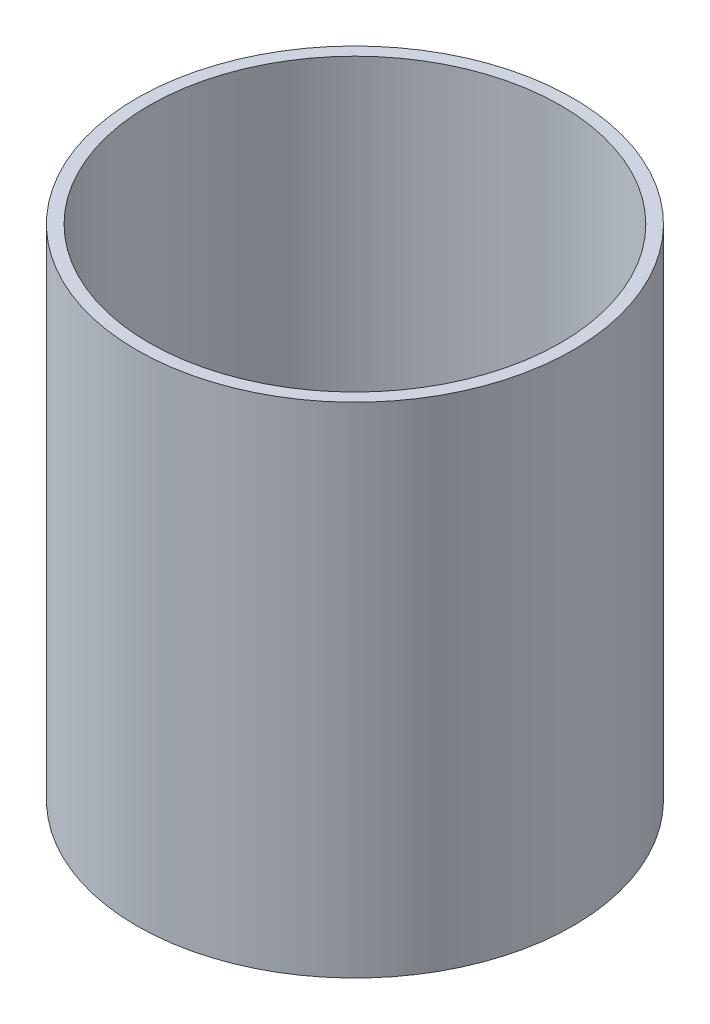
ISO-10303-21;
HEADER;
FILE_DESCRIPTION(('STEP AP214'),'2;1');
FILE_NAME('part.step','',(''),(''),'','','');
FILE_SCHEMA(('AUTOMOTIVE_DESIGN { 1 0 10303 214 1 1 1 1 }'));
ENDSEC;
DATA;
#1=APPLICATION_CONTEXT('core data for automotive mechanical design processes');
#2=APPLICATION_PROTOCOL_DEFINITION('international standard','automotive_design',2000,#1);
#3=PRODUCT_CONTEXT('',#1,'mechanical');
#4=PRODUCT('Part','Part','',(#3));
#5=PRODUCT_RELATED_PRODUCT_CATEGORY('part','',(#4));
#6=PRODUCT_DEFINITION_FORMATION('','',#4);
#7=PRODUCT_DEFINITION_CONTEXT('part definition',#1,'design');
#8=PRODUCT_DEFINITION('design','',#6,#7);
#9=PRODUCT_DEFINITION_SHAPE('','',#8);
#10=(LENGTH_UNIT() NAMED_UNIT(*) SI_UNIT(.MILLI.,.METRE.));
#11=(NAMED_UNIT(*) PLANE_ANGLE_UNIT() SI_UNIT($,.RADIAN.));
#12=(NAMED_UNIT(*) SI_UNIT($,.STERADIAN.) SOLID_ANGLE_UNIT());
#13=UNCERTAINTY_MEASURE_WITH_UNIT(LENGTH_MEASURE(1.E-05),#10,'distance_accuracy_value','');
#14=(GEOMETRIC_REPRESENTATION_CONTEXT(3) GLOBAL_UNCERTAINTY_ASSIGNED_CONTEXT((#13)) GLOBAL_UNIT_ASSIGNED_CONTEXT((#10,
#11,#12)) REPRESENTATION_CONTEXT('',''));
#15=CARTESIAN_POINT('',(0.,0.,0.));
#16=DIRECTION('',(0.,0.,1.));
#17=DIRECTION('',(1.,0.,0.));
#18=AXIS2_PLACEMENT_3D('',#15,#16,#17);
#19=CARTESIAN_POINT('',(0.,50.8,0.));
#20=DIRECTION('',(0.,1.,0.));
#21=DIRECTION('',(0.,0.,1.));
#22=AXIS2_PLACEMENT_3D('',#19,#20,#21);
#23=PLANE('',#22);
#24=CARTESIAN_POINT('',(0.,50.8,0.));
#25=DIRECTION('',(0.,1.,0.));
#26=DIRECTION('',(0.,0.,1.));
#27=AXIS2_PLACEMENT_3D('',#24,#25,#26);
#28=CIRCLE('',#27,22.225);
#29=CARTESIAN_POINT('',(0.,50.8,22.225));
#30=VERTEX_POINT('',#29);
#31=EDGE_CURVE('E12',#30,#30,#28,.T.);
#32=ORIENTED_EDGE('',*,*,#31,.T.);
#33=EDGE_LOOP('',(#32));
#34=FACE_BOUND('',#33,.T.);
#35=CARTESIAN_POINT('',(0.,50.8,0.));
#36=DIRECTION('',(0.,1.,0.));
#37=DIRECTION('',(0.,0.,1.));
#38=AXIS2_PLACEMENT_3D('',#35,#36,#37);
#39=CIRCLE('',#38,20.955);
#40=CARTESIAN_POINT('',(0.,50.8,20.955));
#41=VERTEX_POINT('',#40);
#42=EDGE_CURVE('E55',#41,#41,#39,.T.);
#43=ORIENTED_EDGE('',*,*,#42,.F.);
#44=EDGE_LOOP('',(#43));
#45=FACE_BOUND('',#44,.T.);
#46=ADVANCED_FACE('F44',(#34,#45),#23,.T.);
#47=CARTESIAN_POINT('',(0.,0.,0.));
#48=DIRECTION('',(0.,1.,0.));
#49=DIRECTION('',(0.,0.,1.));
#50=AXIS2_PLACEMENT_3D('',#47,#48,#49);
#51=PLANE('',#50);
#52=CARTESIAN_POINT('',(0.,0.,0.));
#53=DIRECTION('',(0.,1.,0.));
#54=DIRECTION('',(0.,0.,1.));
#55=AXIS2_PLACEMENT_3D('',#52,#53,#54);
#56=CIRCLE('',#55,22.225);
#57=CARTESIAN_POINT('',(0.,0.,22.225));
#58=VERTEX_POINT('',#57);
#59=EDGE_CURVE('E48',#58,#58,#56,.T.);
#60=ORIENTED_EDGE('',*,*,#59,.F.);
#61=EDGE_LOOP('',(#60));
#62=FACE_BOUND('',#61,.T.);
#63=CARTESIAN_POINT('',(0.,0.,0.));
#64=DIRECTION('',(0.,1.,0.));
#65=DIRECTION('',(0.,0.,1.));
#66=AXIS2_PLACEMENT_3D('',#63,#64,#65);
#67=CIRCLE('',#66,20.955);
#68=CARTESIAN_POINT('',(0.,0.,20.955));
#69=VERTEX_POINT('',#68);
#70=EDGE_CURVE('E57',#69,#69,#67,.T.);
#71=ORIENTED_EDGE('',*,*,#70,.T.);
#72=EDGE_LOOP('',(#71));
#73=FACE_BOUND('',#72,.T.);
#74=ADVANCED_FACE('F67',(#62,#73),#51,.F.);
#75=CARTESIAN_POINT('',(0.,50.8,0.));
#76=DIRECTION('',(0.,-1.,0.));
#77=DIRECTION('',(0.,0.,-1.));
#78=AXIS2_PLACEMENT_3D('',#75,#76,#77);
#79=CYLINDRICAL_SURFACE('',#78,22.225);
#80=ORIENTED_EDGE('',*,*,#31,.F.);
#81=EDGE_LOOP('',(#80));
#82=FACE_BOUND('',#81,.T.);
#83=ORIENTED_EDGE('',*,*,#59,.T.);
#84=EDGE_LOOP('',(#83));
#85=FACE_BOUND('',#84,.T.);
#86=ADVANCED_FACE('F46',(#82,#85),#79,.T.);
#87=CARTESIAN_POINT('',(0.,50.8,0.));
#88=DIRECTION('',(0.,-1.,0.));
#89=DIRECTION('',(0.,0.,-1.));
#90=AXIS2_PLACEMENT_3D('',#87,#88,#89);
#91=CYLINDRICAL_SURFACE('',#90,20.955);
#92=ORIENTED_EDGE('',*,*,#42,.T.);
#93=EDGE_LOOP('',(#92));
#94=FACE_BOUND('',#93,.T.);
#95=ORIENTED_EDGE('',*,*,#70,.F.);
#96=EDGE_LOOP('',(#95));
#97=FACE_BOUND('',#96,.T.);
#98=ADVANCED_FACE('F63',(#94,#97),#91,.F.);
#99=CLOSED_SHELL('',(#46,#74,#86,#98));
#100=MANIFOLD_SOLID_BREP('B2',#99);
#101=ADVANCED_BREP_SHAPE_REPRESENTATION('',(#18,#100),#14);
#102=SHAPE_DEFINITION_REPRESENTATION(#9,#101);
ENDSEC;
END-ISO-10303-21;
